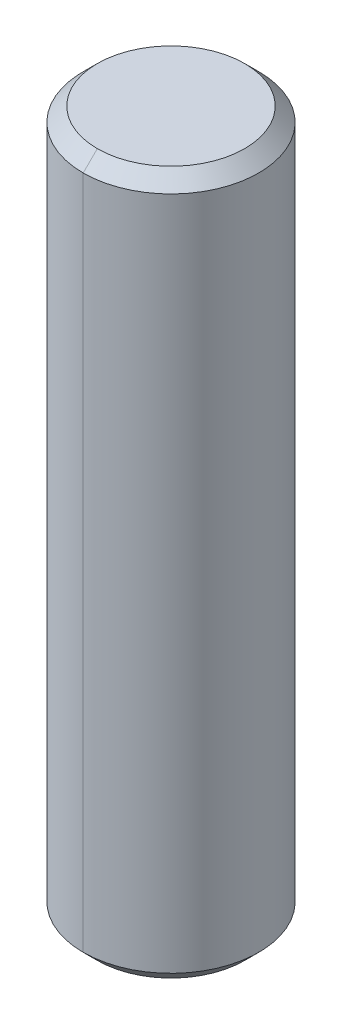
ISO-10303-21;
HEADER;
FILE_DESCRIPTION(('STEP AP214'),'2;1');
FILE_NAME('part.step','',(''),(''),'','','');
FILE_SCHEMA(('AUTOMOTIVE_DESIGN { 1 0 10303 214 1 1 1 1 }'));
ENDSEC;
DATA;
#1=APPLICATION_CONTEXT('core data for automotive mechanical design processes');
#2=APPLICATION_PROTOCOL_DEFINITION('international standard','automotive_design',2000,#1);
#3=PRODUCT_CONTEXT('',#1,'mechanical');
#4=PRODUCT('Part','Part','',(#3));
#5=PRODUCT_RELATED_PRODUCT_CATEGORY('part','',(#4));
#6=PRODUCT_DEFINITION_FORMATION('','',#4);
#7=PRODUCT_DEFINITION_CONTEXT('part definition',#1,'design');
#8=PRODUCT_DEFINITION('design','',#6,#7);
#9=PRODUCT_DEFINITION_SHAPE('','',#8);
#10=(LENGTH_UNIT() NAMED_UNIT(*) SI_UNIT(.MILLI.,.METRE.));
#11=(NAMED_UNIT(*) PLANE_ANGLE_UNIT() SI_UNIT($,.RADIAN.));
#12=(NAMED_UNIT(*) SI_UNIT($,.STERADIAN.) SOLID_ANGLE_UNIT());
#13=UNCERTAINTY_MEASURE_WITH_UNIT(LENGTH_MEASURE(1.E-05),#10,'distance_accuracy_value','');
#14=(GEOMETRIC_REPRESENTATION_CONTEXT(3) GLOBAL_UNCERTAINTY_ASSIGNED_CONTEXT((#13)) GLOBAL_UNIT_ASSIGNED_CONTEXT((#10,
#11,#12)) REPRESENTATION_CONTEXT('',''));
#15=CARTESIAN_POINT('',(0.,0.,0.));
#16=DIRECTION('',(0.,0.,1.));
#17=DIRECTION('',(1.,0.,0.));
#18=AXIS2_PLACEMENT_3D('',#15,#16,#17);
#19=CARTESIAN_POINT('',(0.,25.4,0.));
#20=DIRECTION('',(0.,-1.,0.));
#21=DIRECTION('',(0.,0.,-1.));
#22=AXIS2_PLACEMENT_3D('',#19,#20,#21);
#23=CONICAL_SURFACE('',#22,2.66319,0.785398163397448);
#24=DIRECTION('',(0.,-0.707106781186548,0.707106781186547));
#25=VECTOR('',#24,1.);
#26=CARTESIAN_POINT('',(0.,25.4,2.66319));
#27=LINE('',#26,#25);
#28=CARTESIAN_POINT('',(0.,25.4,2.66319));
#29=VERTEX_POINT('',#28);
#30=CARTESIAN_POINT('',(0.,24.892,3.17119));
#31=VERTEX_POINT('',#30);
#32=EDGE_CURVE('E103',#29,#31,#27,.T.);
#33=ORIENTED_EDGE('',*,*,#32,.F.);
#34=CARTESIAN_POINT('',(0.,25.4,0.));
#35=DIRECTION('',(0.,1.,0.));
#36=DIRECTION('',(0.,0.,1.));
#37=AXIS2_PLACEMENT_3D('',#34,#35,#36);
#38=CIRCLE('',#37,2.66319);
#39=CARTESIAN_POINT('',(0.,25.4,-2.66319));
#40=VERTEX_POINT('',#39);
#41=EDGE_CURVE('E26',#40,#29,#38,.T.);
#42=ORIENTED_EDGE('',*,*,#41,.F.);
#43=DIRECTION('',(0.,-0.707106781186548,-0.707106781186547));
#44=VECTOR('',#43,1.);
#45=CARTESIAN_POINT('',(0.,25.4,-2.66319));
#46=LINE('',#45,#44);
#47=CARTESIAN_POINT('',(0.,24.892,-3.17119));
#48=VERTEX_POINT('',#47);
#49=EDGE_CURVE('E19',#40,#48,#46,.T.);
#50=ORIENTED_EDGE('',*,*,#49,.T.);
#51=CARTESIAN_POINT('',(0.,24.892,0.));
#52=DIRECTION('',(0.,-1.,0.));
#53=DIRECTION('',(0.,0.,1.));
#54=AXIS2_PLACEMENT_3D('',#51,#52,#53);
#55=CIRCLE('',#54,3.17119);
#56=EDGE_CURVE('E96',#31,#48,#55,.T.);
#57=ORIENTED_EDGE('',*,*,#56,.F.);
#58=EDGE_LOOP('',(#33,#42,#50,#57));
#59=FACE_BOUND('',#58,.T.);
#60=ADVANCED_FACE('F15',(#59),#23,.T.);
#61=CARTESIAN_POINT('',(0.,0.508,0.));
#62=DIRECTION('',(0.,1.,0.));
#63=DIRECTION('',(0.,0.,1.));
#64=AXIS2_PLACEMENT_3D('',#61,#62,#63);
#65=CONICAL_SURFACE('',#64,3.17119,0.78539816339745);
#66=DIRECTION('',(0.,0.707106781186546,-0.707106781186549));
#67=VECTOR('',#66,1.);
#68=CARTESIAN_POINT('',(0.,0.508,-3.17119));
#69=LINE('',#68,#67);
#70=CARTESIAN_POINT('',(0.,0.,-2.66319));
#71=VERTEX_POINT('',#70);
#72=CARTESIAN_POINT('',(0.,0.508,-3.17119));
#73=VERTEX_POINT('',#72);
#74=EDGE_CURVE('E69',#71,#73,#69,.T.);
#75=ORIENTED_EDGE('',*,*,#74,.F.);
#76=CARTESIAN_POINT('',(0.,0.,0.));
#77=DIRECTION('',(0.,-1.,0.));
#78=DIRECTION('',(0.,0.,1.));
#79=AXIS2_PLACEMENT_3D('',#76,#77,#78);
#80=CIRCLE('',#79,2.66319);
#81=CARTESIAN_POINT('',(0.,0.,2.66319));
#82=VERTEX_POINT('',#81);
#83=EDGE_CURVE('E10',#82,#71,#80,.T.);
#84=ORIENTED_EDGE('',*,*,#83,.F.);
#85=DIRECTION('',(0.,0.707106781186546,0.707106781186549));
#86=VECTOR('',#85,1.);
#87=CARTESIAN_POINT('',(0.,0.508,3.17119));
#88=LINE('',#87,#86);
#89=CARTESIAN_POINT('',(0.,0.508,3.17119));
#90=VERTEX_POINT('',#89);
#91=EDGE_CURVE('E66',#82,#90,#88,.T.);
#92=ORIENTED_EDGE('',*,*,#91,.T.);
#93=CARTESIAN_POINT('',(0.,0.508,0.));
#94=DIRECTION('',(0.,1.,0.));
#95=DIRECTION('',(0.,0.,1.));
#96=AXIS2_PLACEMENT_3D('',#93,#94,#95);
#97=CIRCLE('',#96,3.17119);
#98=EDGE_CURVE('E41',#73,#90,#97,.T.);
#99=ORIENTED_EDGE('',*,*,#98,.F.);
#100=EDGE_LOOP('',(#75,#84,#92,#99));
#101=FACE_BOUND('',#100,.T.);
#102=ADVANCED_FACE('F65',(#101),#65,.T.);
#103=CARTESIAN_POINT('',(0.,0.,0.));
#104=DIRECTION('',(0.,1.,0.));
#105=DIRECTION('',(1.,0.,0.));
#106=AXIS2_PLACEMENT_3D('',#103,#104,#105);
#107=PLANE('',#106);
#108=ORIENTED_EDGE('',*,*,#83,.T.);
#109=CARTESIAN_POINT('',(0.,0.,0.));
#110=DIRECTION('',(0.,-1.,0.));
#111=DIRECTION('',(0.,0.,1.));
#112=AXIS2_PLACEMENT_3D('',#109,#110,#111);
#113=CIRCLE('',#112,2.66319);
#114=EDGE_CURVE('E75',#71,#82,#113,.T.);
#115=ORIENTED_EDGE('',*,*,#114,.T.);
#116=EDGE_LOOP('',(#108,#115));
#117=FACE_BOUND('',#116,.T.);
#118=ADVANCED_FACE('F81',(#117),#107,.F.);
#119=CARTESIAN_POINT('',(0.,25.4,0.));
#120=DIRECTION('',(0.,1.,0.));
#121=DIRECTION('',(1.,0.,0.));
#122=AXIS2_PLACEMENT_3D('',#119,#120,#121);
#123=PLANE('',#122);
#124=ORIENTED_EDGE('',*,*,#41,.T.);
#125=CARTESIAN_POINT('',(0.,25.4,0.));
#126=DIRECTION('',(0.,1.,0.));
#127=DIRECTION('',(0.,0.,1.));
#128=AXIS2_PLACEMENT_3D('',#125,#126,#127);
#129=CIRCLE('',#128,2.66319);
#130=EDGE_CURVE('E118',#29,#40,#129,.T.);
#131=ORIENTED_EDGE('',*,*,#130,.T.);
#132=EDGE_LOOP('',(#124,#131));
#133=FACE_BOUND('',#132,.T.);
#134=ADVANCED_FACE('F17',(#133),#123,.T.);
#135=CARTESIAN_POINT('',(0.,25.4,0.));
#136=DIRECTION('',(0.,-1.,0.));
#137=DIRECTION('',(0.,0.,-1.));
#138=AXIS2_PLACEMENT_3D('',#135,#136,#137);
#139=CYLINDRICAL_SURFACE('',#138,3.17119);
#140=DIRECTION('',(0.,-1.,0.));
#141=VECTOR('',#140,1.);
#142=CARTESIAN_POINT('',(0.,25.4,3.17119));
#143=LINE('',#142,#141);
#144=EDGE_CURVE('E79',#31,#90,#143,.T.);
#145=ORIENTED_EDGE('',*,*,#144,.F.);
#146=ORIENTED_EDGE('',*,*,#56,.T.);
#147=DIRECTION('',(0.,-1.,0.));
#148=VECTOR('',#147,1.);
#149=CARTESIAN_POINT('',(0.,25.4,-3.17119));
#150=LINE('',#149,#148);
#151=EDGE_CURVE('E98',#48,#73,#150,.T.);
#152=ORIENTED_EDGE('',*,*,#151,.T.);
#153=ORIENTED_EDGE('',*,*,#98,.T.);
#154=EDGE_LOOP('',(#145,#146,#152,#153));
#155=FACE_BOUND('',#154,.T.);
#156=ADVANCED_FACE('F173',(#155),#139,.T.);
#157=CARTESIAN_POINT('',(0.,25.4,0.));
#158=DIRECTION('',(0.,-1.,0.));
#159=DIRECTION('',(0.,0.,-1.));
#160=AXIS2_PLACEMENT_3D('',#157,#158,#159);
#161=CYLINDRICAL_SURFACE('',#160,3.17119);
#162=CARTESIAN_POINT('',(0.,24.892,0.));
#163=DIRECTION('',(0.,-1.,0.));
#164=DIRECTION('',(0.,0.,1.));
#165=AXIS2_PLACEMENT_3D('',#162,#163,#164);
#166=CIRCLE('',#165,3.17119);
#167=EDGE_CURVE('E92',#48,#31,#166,.T.);
#168=ORIENTED_EDGE('',*,*,#167,.T.);
#169=ORIENTED_EDGE('',*,*,#144,.T.);
#170=CARTESIAN_POINT('',(0.,0.508,0.));
#171=DIRECTION('',(0.,1.,0.));
#172=DIRECTION('',(0.,0.,1.));
#173=AXIS2_PLACEMENT_3D('',#170,#171,#172);
#174=CIRCLE('',#173,3.17119);
#175=EDGE_CURVE('E77',#90,#73,#174,.T.);
#176=ORIENTED_EDGE('',*,*,#175,.T.);
#177=ORIENTED_EDGE('',*,*,#151,.F.);
#178=EDGE_LOOP('',(#168,#169,#176,#177));
#179=FACE_BOUND('',#178,.T.);
#180=ADVANCED_FACE('F177',(#179),#161,.T.);
#181=CARTESIAN_POINT('',(0.,0.508,0.));
#182=DIRECTION('',(0.,1.,0.));
#183=DIRECTION('',(0.,0.,1.));
#184=AXIS2_PLACEMENT_3D('',#181,#182,#183);
#185=CONICAL_SURFACE('',#184,3.17119,0.78539816339745);
#186=ORIENTED_EDGE('',*,*,#114,.F.);
#187=ORIENTED_EDGE('',*,*,#74,.T.);
#188=ORIENTED_EDGE('',*,*,#175,.F.);
#189=ORIENTED_EDGE('',*,*,#91,.F.);
#190=EDGE_LOOP('',(#186,#187,#188,#189));
#191=FACE_BOUND('',#190,.T.);
#192=ADVANCED_FACE('F74',(#191),#185,.T.);
#193=CARTESIAN_POINT('',(0.,25.4,0.));
#194=DIRECTION('',(0.,-1.,0.));
#195=DIRECTION('',(0.,0.,-1.));
#196=AXIS2_PLACEMENT_3D('',#193,#194,#195);
#197=CONICAL_SURFACE('',#196,2.66319,0.785398163397448);
#198=ORIENTED_EDGE('',*,*,#130,.F.);
#199=ORIENTED_EDGE('',*,*,#32,.T.);
#200=ORIENTED_EDGE('',*,*,#167,.F.);
#201=ORIENTED_EDGE('',*,*,#49,.F.);
#202=EDGE_LOOP('',(#198,#199,#200,#201));
#203=FACE_BOUND('',#202,.T.);
#204=ADVANCED_FACE('F127',(#203),#197,.T.);
#205=CLOSED_SHELL('',(#60,#102,#118,#134,#156,#180,#192,#204));
#206=MANIFOLD_SOLID_BREP('B1',#205);
#207=ADVANCED_BREP_SHAPE_REPRESENTATION('',(#18,#206),#14);
#208=SHAPE_DEFINITION_REPRESENTATION(#9,#207);
ENDSEC;
END-ISO-10303-21;
